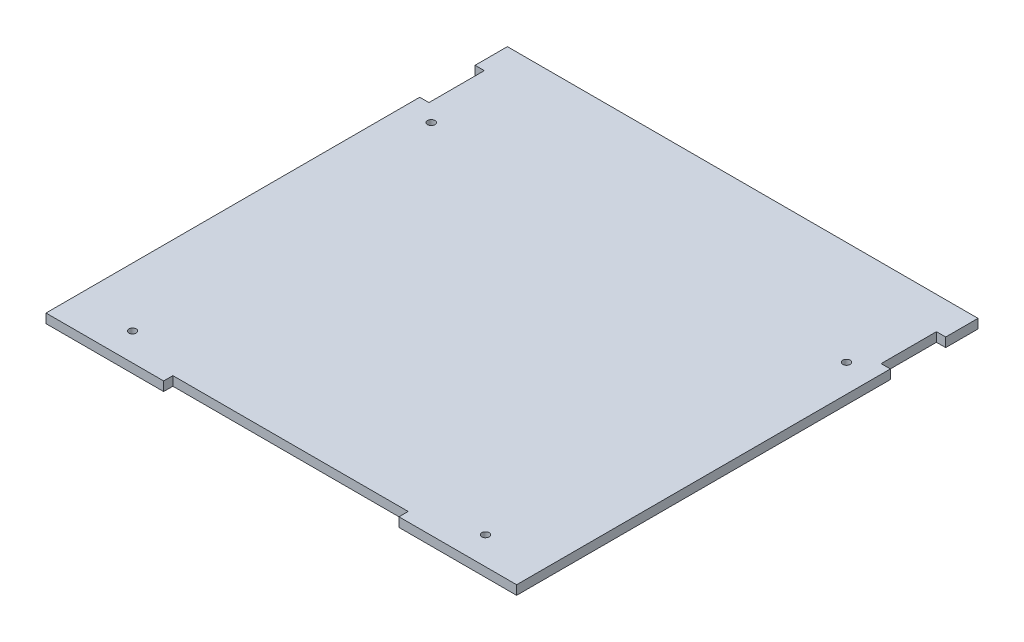
ISO-10303-21;
HEADER;
FILE_DESCRIPTION(('STEP AP214'),'2;1');
FILE_NAME('part.step','',(''),(''),'','','');
FILE_SCHEMA(('AUTOMOTIVE_DESIGN { 1 0 10303 214 1 1 1 1 }'));
ENDSEC;
DATA;
#1=APPLICATION_CONTEXT('core data for automotive mechanical design processes');
#2=APPLICATION_PROTOCOL_DEFINITION('international standard','automotive_design',2000,#1);
#3=PRODUCT_CONTEXT('',#1,'mechanical');
#4=PRODUCT('Part','Part','',(#3));
#5=PRODUCT_RELATED_PRODUCT_CATEGORY('part','',(#4));
#6=PRODUCT_DEFINITION_FORMATION('','',#4);
#7=PRODUCT_DEFINITION_CONTEXT('part definition',#1,'design');
#8=PRODUCT_DEFINITION('design','',#6,#7);
#9=PRODUCT_DEFINITION_SHAPE('','',#8);
#10=(LENGTH_UNIT() NAMED_UNIT(*) SI_UNIT(.MILLI.,.METRE.));
#11=(NAMED_UNIT(*) PLANE_ANGLE_UNIT() SI_UNIT($,.RADIAN.));
#12=(NAMED_UNIT(*) SI_UNIT($,.STERADIAN.) SOLID_ANGLE_UNIT());
#13=UNCERTAINTY_MEASURE_WITH_UNIT(LENGTH_MEASURE(1.E-05),#10,'distance_accuracy_value','');
#14=(GEOMETRIC_REPRESENTATION_CONTEXT(3) GLOBAL_UNCERTAINTY_ASSIGNED_CONTEXT((#13)) GLOBAL_UNIT_ASSIGNED_CONTEXT((#10,
#11,#12)) REPRESENTATION_CONTEXT('',''));
#15=CARTESIAN_POINT('',(0.,0.,0.));
#16=DIRECTION('',(0.,0.,1.));
#17=DIRECTION('',(1.,0.,0.));
#18=AXIS2_PLACEMENT_3D('',#15,#16,#17);
#19=CARTESIAN_POINT('',(0.,5.,0.));
#20=DIRECTION('',(0.,-1.,0.));
#21=DIRECTION('',(0.,0.,-1.));
#22=AXIS2_PLACEMENT_3D('',#19,#20,#21);
#23=PLANE('',#22);
#24=CARTESIAN_POINT('',(240.,5.,-8.75));
#25=DIRECTION('',(0.,1.,0.));
#26=DIRECTION('',(0.,0.,1.));
#27=AXIS2_PLACEMENT_3D('',#24,#25,#26);
#28=CIRCLE('',#27,2.);
#29=CARTESIAN_POINT('',(240.,5.,-6.75));
#30=VERTEX_POINT('',#29);
#31=EDGE_CURVE('E262',#30,#30,#28,.T.);
#32=ORIENTED_EDGE('',*,*,#31,.F.);
#33=EDGE_LOOP('',(#32));
#34=FACE_BOUND('',#33,.T.);
#35=CARTESIAN_POINT('',(15.,5.,-8.75));
#36=DIRECTION('',(0.,1.,0.));
#37=DIRECTION('',(0.,0.,1.));
#38=AXIS2_PLACEMENT_3D('',#35,#36,#37);
#39=CIRCLE('',#38,2.);
#40=CARTESIAN_POINT('',(15.,5.,-6.75));
#41=VERTEX_POINT('',#40);
#42=EDGE_CURVE('E552',#41,#41,#39,.T.);
#43=ORIENTED_EDGE('',*,*,#42,.F.);
#44=EDGE_LOOP('',(#43));
#45=FACE_BOUND('',#44,.T.);
#46=CARTESIAN_POINT('',(31.875,5.,170.));
#47=DIRECTION('',(0.,1.,0.));
#48=DIRECTION('',(0.,0.,1.));
#49=AXIS2_PLACEMENT_3D('',#46,#47,#48);
#50=CIRCLE('',#49,2.);
#51=CARTESIAN_POINT('',(31.875,5.,172.));
#52=VERTEX_POINT('',#51);
#53=EDGE_CURVE('E553',#52,#52,#50,.T.);
#54=ORIENTED_EDGE('',*,*,#53,.F.);
#55=EDGE_LOOP('',(#54));
#56=FACE_BOUND('',#55,.T.);
#57=CARTESIAN_POINT('',(223.125,5.,170.));
#58=DIRECTION('',(0.,1.,0.));
#59=DIRECTION('',(0.,0.,1.));
#60=AXIS2_PLACEMENT_3D('',#57,#58,#59);
#61=CIRCLE('',#60,2.);
#62=CARTESIAN_POINT('',(223.125,5.,172.));
#63=VERTEX_POINT('',#62);
#64=EDGE_CURVE('E558',#63,#63,#61,.T.);
#65=ORIENTED_EDGE('',*,*,#64,.F.);
#66=EDGE_LOOP('',(#65));
#67=FACE_BOUND('',#66,.T.);
#68=DIRECTION('',(-1.,0.,0.));
#69=VECTOR('',#68,1.);
#70=CARTESIAN_POINT('',(255.,5.,185.));
#71=LINE('',#70,#69);
#72=CARTESIAN_POINT('',(63.75,5.,185.));
#73=VERTEX_POINT('',#72);
#74=CARTESIAN_POINT('',(0.,5.,185.));
#75=VERTEX_POINT('',#74);
#76=EDGE_CURVE('E172',#73,#75,#71,.T.);
#77=ORIENTED_EDGE('',*,*,#76,.F.);
#78=DIRECTION('',(0.,0.,1.));
#79=VECTOR('',#78,1.);
#80=CARTESIAN_POINT('',(63.75,5.,180.));
#81=LINE('',#80,#79);
#82=CARTESIAN_POINT('',(63.75,5.,180.));
#83=VERTEX_POINT('',#82);
#84=EDGE_CURVE('E564',#83,#73,#81,.T.);
#85=ORIENTED_EDGE('',*,*,#84,.F.);
#86=DIRECTION('',(-1.,0.,0.));
#87=VECTOR('',#86,1.);
#88=CARTESIAN_POINT('',(127.5,5.,180.));
#89=LINE('',#88,#87);
#90=CARTESIAN_POINT('',(191.25,5.,180.));
#91=VERTEX_POINT('',#90);
#92=EDGE_CURVE('E166',#91,#83,#89,.T.);
#93=ORIENTED_EDGE('',*,*,#92,.F.);
#94=DIRECTION('',(0.,0.,-1.));
#95=VECTOR('',#94,1.);
#96=CARTESIAN_POINT('',(191.25,5.,185.));
#97=LINE('',#96,#95);
#98=CARTESIAN_POINT('',(191.25,5.,185.));
#99=VERTEX_POINT('',#98);
#100=EDGE_CURVE('E151',#99,#91,#97,.T.);
#101=ORIENTED_EDGE('',*,*,#100,.F.);
#102=CARTESIAN_POINT('',(255.,5.,185.));
#103=VERTEX_POINT('',#102);
#104=EDGE_CURVE('E162',#103,#99,#71,.T.);
#105=ORIENTED_EDGE('',*,*,#104,.F.);
#106=DIRECTION('',(0.,0.,-1.));
#107=VECTOR('',#106,1.);
#108=CARTESIAN_POINT('',(255.,5.,0.));
#109=LINE('',#108,#107);
#110=CARTESIAN_POINT('',(255.,5.,-17.5));
#111=VERTEX_POINT('',#110);
#112=EDGE_CURVE('E199',#103,#111,#109,.T.);
#113=ORIENTED_EDGE('',*,*,#112,.T.);
#114=DIRECTION('',(-1.,0.,0.));
#115=VECTOR('',#114,1.);
#116=CARTESIAN_POINT('',(255.,5.,-17.5));
#117=LINE('',#116,#115);
#118=CARTESIAN_POINT('',(250.,5.,-17.5));
#119=VERTEX_POINT('',#118);
#120=EDGE_CURVE('E204',#111,#119,#117,.T.);
#121=ORIENTED_EDGE('',*,*,#120,.T.);
#122=DIRECTION('',(0.,0.,-1.));
#123=VECTOR('',#122,1.);
#124=CARTESIAN_POINT('',(250.,5.,-17.5));
#125=LINE('',#124,#123);
#126=CARTESIAN_POINT('',(250.,5.,-47.5));
#127=VERTEX_POINT('',#126);
#128=EDGE_CURVE('E231',#119,#127,#125,.T.);
#129=ORIENTED_EDGE('',*,*,#128,.T.);
#130=DIRECTION('',(1.,0.,0.));
#131=VECTOR('',#130,1.);
#132=CARTESIAN_POINT('',(250.,5.,-47.5));
#133=LINE('',#132,#131);
#134=CARTESIAN_POINT('',(255.,5.,-47.5));
#135=VERTEX_POINT('',#134);
#136=EDGE_CURVE('E228',#127,#135,#133,.T.);
#137=ORIENTED_EDGE('',*,*,#136,.T.);
#138=CARTESIAN_POINT('',(255.,5.,-65.));
#139=VERTEX_POINT('',#138);
#140=EDGE_CURVE('E196',#135,#139,#109,.T.);
#141=ORIENTED_EDGE('',*,*,#140,.T.);
#142=DIRECTION('',(-1.,0.,0.));
#143=VECTOR('',#142,1.);
#144=CARTESIAN_POINT('',(0.,5.,-65.));
#145=LINE('',#144,#143);
#146=CARTESIAN_POINT('',(0.,5.,-65.));
#147=VERTEX_POINT('',#146);
#148=EDGE_CURVE('E236',#139,#147,#145,.T.);
#149=ORIENTED_EDGE('',*,*,#148,.T.);
#150=DIRECTION('',(0.,0.,1.));
#151=VECTOR('',#150,1.);
#152=CARTESIAN_POINT('',(0.,5.,0.));
#153=LINE('',#152,#151);
#154=CARTESIAN_POINT('',(0.,5.,-47.5));
#155=VERTEX_POINT('',#154);
#156=EDGE_CURVE('E195',#147,#155,#153,.T.);
#157=ORIENTED_EDGE('',*,*,#156,.T.);
#158=DIRECTION('',(-1.,0.,0.));
#159=VECTOR('',#158,1.);
#160=CARTESIAN_POINT('',(5.,5.,-47.5));
#161=LINE('',#160,#159);
#162=CARTESIAN_POINT('',(5.,5.,-47.5));
#163=VERTEX_POINT('',#162);
#164=EDGE_CURVE('E207',#163,#155,#161,.T.);
#165=ORIENTED_EDGE('',*,*,#164,.F.);
#166=DIRECTION('',(0.,0.,-1.));
#167=VECTOR('',#166,1.);
#168=CARTESIAN_POINT('',(5.,5.,-17.5));
#169=LINE('',#168,#167);
#170=CARTESIAN_POINT('',(5.,5.,-17.5));
#171=VERTEX_POINT('',#170);
#172=EDGE_CURVE('E203',#171,#163,#169,.T.);
#173=ORIENTED_EDGE('',*,*,#172,.F.);
#174=DIRECTION('',(1.,0.,0.));
#175=VECTOR('',#174,1.);
#176=CARTESIAN_POINT('',(0.,5.,-17.5));
#177=LINE('',#176,#175);
#178=CARTESIAN_POINT('',(0.,5.,-17.5));
#179=VERTEX_POINT('',#178);
#180=EDGE_CURVE('E200',#179,#171,#177,.T.);
#181=ORIENTED_EDGE('',*,*,#180,.F.);
#182=EDGE_CURVE('E59',#179,#75,#153,.T.);
#183=ORIENTED_EDGE('',*,*,#182,.T.);
#184=EDGE_LOOP('',(#77,#85,#93,#101,#105,#113,#121,#129,#137,#141,#149,#157,#165,#173,#181,#183));
#185=FACE_BOUND('',#184,.T.);
#186=ADVANCED_FACE('F34',(#34,#45,#56,#67,#185),#23,.F.);
#187=CARTESIAN_POINT('',(0.,0.,0.));
#188=DIRECTION('',(0.,-1.,0.));
#189=DIRECTION('',(0.,0.,-1.));
#190=AXIS2_PLACEMENT_3D('',#187,#188,#189);
#191=PLANE('',#190);
#192=CARTESIAN_POINT('',(240.,0.,-8.75));
#193=DIRECTION('',(0.,-1.,0.));
#194=DIRECTION('',(0.,0.,-1.));
#195=AXIS2_PLACEMENT_3D('',#192,#193,#194);
#196=CIRCLE('',#195,2.);
#197=CARTESIAN_POINT('',(240.,0.,-10.75));
#198=VERTEX_POINT('',#197);
#199=EDGE_CURVE('E38',#198,#198,#196,.T.);
#200=ORIENTED_EDGE('',*,*,#199,.F.);
#201=EDGE_LOOP('',(#200));
#202=FACE_BOUND('',#201,.T.);
#203=CARTESIAN_POINT('',(15.,0.,-8.75));
#204=DIRECTION('',(0.,-1.,0.));
#205=DIRECTION('',(0.,0.,-1.));
#206=AXIS2_PLACEMENT_3D('',#203,#204,#205);
#207=CIRCLE('',#206,2.);
#208=CARTESIAN_POINT('',(15.,0.,-10.75));
#209=VERTEX_POINT('',#208);
#210=EDGE_CURVE('E264',#209,#209,#207,.T.);
#211=ORIENTED_EDGE('',*,*,#210,.F.);
#212=EDGE_LOOP('',(#211));
#213=FACE_BOUND('',#212,.T.);
#214=CARTESIAN_POINT('',(31.875,0.,170.));
#215=DIRECTION('',(0.,-1.,0.));
#216=DIRECTION('',(0.,0.,-1.));
#217=AXIS2_PLACEMENT_3D('',#214,#215,#216);
#218=CIRCLE('',#217,2.);
#219=CARTESIAN_POINT('',(31.875,0.,168.));
#220=VERTEX_POINT('',#219);
#221=EDGE_CURVE('E261',#220,#220,#218,.T.);
#222=ORIENTED_EDGE('',*,*,#221,.F.);
#223=EDGE_LOOP('',(#222));
#224=FACE_BOUND('',#223,.T.);
#225=CARTESIAN_POINT('',(223.125,0.,170.));
#226=DIRECTION('',(0.,-1.,0.));
#227=DIRECTION('',(0.,0.,-1.));
#228=AXIS2_PLACEMENT_3D('',#225,#226,#227);
#229=CIRCLE('',#228,2.);
#230=CARTESIAN_POINT('',(223.125,0.,168.));
#231=VERTEX_POINT('',#230);
#232=EDGE_CURVE('E258',#231,#231,#229,.T.);
#233=ORIENTED_EDGE('',*,*,#232,.F.);
#234=EDGE_LOOP('',(#233));
#235=FACE_BOUND('',#234,.T.);
#236=DIRECTION('',(0.,0.,-1.));
#237=VECTOR('',#236,1.);
#238=CARTESIAN_POINT('',(63.75,0.,0.));
#239=LINE('',#238,#237);
#240=CARTESIAN_POINT('',(63.75,0.,185.));
#241=VERTEX_POINT('',#240);
#242=CARTESIAN_POINT('',(63.75,0.,180.));
#243=VERTEX_POINT('',#242);
#244=EDGE_CURVE('E286',#241,#243,#239,.T.);
#245=ORIENTED_EDGE('',*,*,#244,.F.);
#246=DIRECTION('',(1.,0.,0.));
#247=VECTOR('',#246,1.);
#248=CARTESIAN_POINT('',(255.,0.,185.));
#249=LINE('',#248,#247);
#250=CARTESIAN_POINT('',(0.,0.,185.));
#251=VERTEX_POINT('',#250);
#252=EDGE_CURVE('E180',#251,#241,#249,.T.);
#253=ORIENTED_EDGE('',*,*,#252,.F.);
#254=DIRECTION('',(0.,0.,1.));
#255=VECTOR('',#254,1.);
#256=CARTESIAN_POINT('',(0.,0.,-65.));
#257=LINE('',#256,#255);
#258=CARTESIAN_POINT('',(0.,0.,-17.5));
#259=VERTEX_POINT('',#258);
#260=EDGE_CURVE('E183',#259,#251,#257,.T.);
#261=ORIENTED_EDGE('',*,*,#260,.F.);
#262=DIRECTION('',(-1.,0.,0.));
#263=VECTOR('',#262,1.);
#264=CARTESIAN_POINT('',(0.,0.,-17.5));
#265=LINE('',#264,#263);
#266=CARTESIAN_POINT('',(5.,0.,-17.5));
#267=VERTEX_POINT('',#266);
#268=EDGE_CURVE('E250',#267,#259,#265,.T.);
#269=ORIENTED_EDGE('',*,*,#268,.F.);
#270=DIRECTION('',(0.,0.,1.));
#271=VECTOR('',#270,1.);
#272=CARTESIAN_POINT('',(5.,0.,0.));
#273=LINE('',#272,#271);
#274=CARTESIAN_POINT('',(5.,0.,-47.5));
#275=VERTEX_POINT('',#274);
#276=EDGE_CURVE('E253',#275,#267,#273,.T.);
#277=ORIENTED_EDGE('',*,*,#276,.F.);
#278=DIRECTION('',(1.,0.,0.));
#279=VECTOR('',#278,1.);
#280=CARTESIAN_POINT('',(0.,0.,-47.5));
#281=LINE('',#280,#279);
#282=CARTESIAN_POINT('',(0.,0.,-47.5));
#283=VERTEX_POINT('',#282);
#284=EDGE_CURVE('E156',#283,#275,#281,.T.);
#285=ORIENTED_EDGE('',*,*,#284,.F.);
#286=CARTESIAN_POINT('',(0.,0.,-65.));
#287=VERTEX_POINT('',#286);
#288=EDGE_CURVE('E190',#287,#283,#257,.T.);
#289=ORIENTED_EDGE('',*,*,#288,.F.);
#290=DIRECTION('',(-1.,0.,0.));
#291=VECTOR('',#290,1.);
#292=CARTESIAN_POINT('',(0.,0.,-65.));
#293=LINE('',#292,#291);
#294=CARTESIAN_POINT('',(255.,0.,-65.));
#295=VERTEX_POINT('',#294);
#296=EDGE_CURVE('E213',#295,#287,#293,.T.);
#297=ORIENTED_EDGE('',*,*,#296,.F.);
#298=DIRECTION('',(0.,0.,-1.));
#299=VECTOR('',#298,1.);
#300=CARTESIAN_POINT('',(255.,0.,-47.5));
#301=LINE('',#300,#299);
#302=CARTESIAN_POINT('',(255.,0.,-47.5));
#303=VERTEX_POINT('',#302);
#304=EDGE_CURVE('E187',#303,#295,#301,.T.);
#305=ORIENTED_EDGE('',*,*,#304,.F.);
#306=DIRECTION('',(-1.,0.,0.));
#307=VECTOR('',#306,1.);
#308=CARTESIAN_POINT('',(0.,0.,-47.5));
#309=LINE('',#308,#307);
#310=CARTESIAN_POINT('',(250.,0.,-47.5));
#311=VERTEX_POINT('',#310);
#312=EDGE_CURVE('E239',#303,#311,#309,.T.);
#313=ORIENTED_EDGE('',*,*,#312,.T.);
#314=DIRECTION('',(0.,0.,1.));
#315=VECTOR('',#314,1.);
#316=CARTESIAN_POINT('',(250.,0.,0.));
#317=LINE('',#316,#315);
#318=CARTESIAN_POINT('',(250.,0.,-17.5));
#319=VERTEX_POINT('',#318);
#320=EDGE_CURVE('E244',#311,#319,#317,.T.);
#321=ORIENTED_EDGE('',*,*,#320,.T.);
#322=DIRECTION('',(1.,0.,0.));
#323=VECTOR('',#322,1.);
#324=CARTESIAN_POINT('',(0.,0.,-17.5));
#325=LINE('',#324,#323);
#326=CARTESIAN_POINT('',(255.,0.,-17.5));
#327=VERTEX_POINT('',#326);
#328=EDGE_CURVE('E247',#319,#327,#325,.T.);
#329=ORIENTED_EDGE('',*,*,#328,.T.);
#330=CARTESIAN_POINT('',(255.,0.,185.));
#331=VERTEX_POINT('',#330);
#332=EDGE_CURVE('E184',#331,#327,#301,.T.);
#333=ORIENTED_EDGE('',*,*,#332,.F.);
#334=CARTESIAN_POINT('',(191.25,0.,185.));
#335=VERTEX_POINT('',#334);
#336=EDGE_CURVE('E175',#335,#331,#249,.T.);
#337=ORIENTED_EDGE('',*,*,#336,.F.);
#338=DIRECTION('',(0.,0.,1.));
#339=VECTOR('',#338,1.);
#340=CARTESIAN_POINT('',(191.25,0.,0.));
#341=LINE('',#340,#339);
#342=CARTESIAN_POINT('',(191.25,0.,180.));
#343=VERTEX_POINT('',#342);
#344=EDGE_CURVE('E51',#343,#335,#341,.T.);
#345=ORIENTED_EDGE('',*,*,#344,.F.);
#346=DIRECTION('',(1.,0.,0.));
#347=VECTOR('',#346,1.);
#348=CARTESIAN_POINT('',(0.,0.,180.));
#349=LINE('',#348,#347);
#350=EDGE_CURVE('E11',#243,#343,#349,.T.);
#351=ORIENTED_EDGE('',*,*,#350,.F.);
#352=EDGE_LOOP('',(#245,#253,#261,#269,#277,#285,#289,#297,#305,#313,#321,#329,#333,#337,#345,#351));
#353=FACE_BOUND('',#352,.T.);
#354=ADVANCED_FACE('F274',(#202,#213,#224,#235,#353),#191,.T.);
#355=CARTESIAN_POINT('',(0.,0.,185.));
#356=DIRECTION('',(0.,0.,1.));
#357=DIRECTION('',(1.,0.,0.));
#358=AXIS2_PLACEMENT_3D('',#355,#356,#357);
#359=PLANE('',#358);
#360=DIRECTION('',(0.,-1.,0.));
#361=VECTOR('',#360,1.);
#362=CARTESIAN_POINT('',(63.75,0.,185.));
#363=LINE('',#362,#361);
#364=EDGE_CURVE('E43',#73,#241,#363,.T.);
#365=ORIENTED_EDGE('',*,*,#364,.F.);
#366=ORIENTED_EDGE('',*,*,#76,.T.);
#367=DIRECTION('',(0.,-1.,0.));
#368=VECTOR('',#367,1.);
#369=CARTESIAN_POINT('',(0.,0.,185.));
#370=LINE('',#369,#368);
#371=EDGE_CURVE('E171',#75,#251,#370,.T.);
#372=ORIENTED_EDGE('',*,*,#371,.T.);
#373=ORIENTED_EDGE('',*,*,#252,.T.);
#374=EDGE_LOOP('',(#365,#366,#372,#373));
#375=FACE_BOUND('',#374,.T.);
#376=ADVANCED_FACE('F277',(#375),#359,.T.);
#377=CARTESIAN_POINT('',(0.,5.,-65.));
#378=DIRECTION('',(0.,0.,1.));
#379=DIRECTION('',(1.,0.,0.));
#380=AXIS2_PLACEMENT_3D('',#377,#378,#379);
#381=PLANE('',#380);
#382=ORIENTED_EDGE('',*,*,#148,.F.);
#383=DIRECTION('',(0.,-1.,0.));
#384=VECTOR('',#383,1.);
#385=CARTESIAN_POINT('',(255.,10.,-65.));
#386=LINE('',#385,#384);
#387=EDGE_CURVE('E186',#139,#295,#386,.T.);
#388=ORIENTED_EDGE('',*,*,#387,.T.);
#389=ORIENTED_EDGE('',*,*,#296,.T.);
#390=DIRECTION('',(0.,-1.,0.));
#391=VECTOR('',#390,1.);
#392=CARTESIAN_POINT('',(0.,10.,-65.));
#393=LINE('',#392,#391);
#394=EDGE_CURVE('E192',#147,#287,#393,.T.);
#395=ORIENTED_EDGE('',*,*,#394,.F.);
#396=EDGE_LOOP('',(#382,#388,#389,#395));
#397=FACE_BOUND('',#396,.T.);
#398=ADVANCED_FACE('F36',(#397),#381,.F.);
#399=CARTESIAN_POINT('',(255.,-5.,-17.5));
#400=DIRECTION('',(0.,0.,-1.));
#401=DIRECTION('',(-1.,0.,0.));
#402=AXIS2_PLACEMENT_3D('',#399,#400,#401);
#403=PLANE('',#402);
#404=DIRECTION('',(0.,1.,0.));
#405=VECTOR('',#404,1.);
#406=CARTESIAN_POINT('',(250.,-5.,-17.5));
#407=LINE('',#406,#405);
#408=EDGE_CURVE('E221',#319,#119,#407,.T.);
#409=ORIENTED_EDGE('',*,*,#408,.T.);
#410=ORIENTED_EDGE('',*,*,#120,.F.);
#411=DIRECTION('',(0.,1.,0.));
#412=VECTOR('',#411,1.);
#413=CARTESIAN_POINT('',(255.,-5.,-17.5));
#414=LINE('',#413,#412);
#415=EDGE_CURVE('E219',#327,#111,#414,.T.);
#416=ORIENTED_EDGE('',*,*,#415,.F.);
#417=ORIENTED_EDGE('',*,*,#328,.F.);
#418=EDGE_LOOP('',(#409,#410,#416,#417));
#419=FACE_BOUND('',#418,.T.);
#420=ADVANCED_FACE('F329',(#419),#403,.T.);
#421=CARTESIAN_POINT('',(250.,-5.,-17.5));
#422=DIRECTION('',(1.,0.,0.));
#423=DIRECTION('',(0.,0.,-1.));
#424=AXIS2_PLACEMENT_3D('',#421,#422,#423);
#425=PLANE('',#424);
#426=DIRECTION('',(0.,1.,0.));
#427=VECTOR('',#426,1.);
#428=CARTESIAN_POINT('',(250.,-5.,-47.5));
#429=LINE('',#428,#427);
#430=EDGE_CURVE('E223',#311,#127,#429,.T.);
#431=ORIENTED_EDGE('',*,*,#430,.T.);
#432=ORIENTED_EDGE('',*,*,#128,.F.);
#433=ORIENTED_EDGE('',*,*,#408,.F.);
#434=ORIENTED_EDGE('',*,*,#320,.F.);
#435=EDGE_LOOP('',(#431,#432,#433,#434));
#436=FACE_BOUND('',#435,.T.);
#437=ADVANCED_FACE('F325',(#436),#425,.T.);
#438=CARTESIAN_POINT('',(250.,-5.,-47.5));
#439=DIRECTION('',(0.,0.,1.));
#440=DIRECTION('',(1.,0.,0.));
#441=AXIS2_PLACEMENT_3D('',#438,#439,#440);
#442=PLANE('',#441);
#443=DIRECTION('',(0.,1.,0.));
#444=VECTOR('',#443,1.);
#445=CARTESIAN_POINT('',(255.,-5.,-47.5));
#446=LINE('',#445,#444);
#447=EDGE_CURVE('E225',#303,#135,#446,.T.);
#448=ORIENTED_EDGE('',*,*,#447,.T.);
#449=ORIENTED_EDGE('',*,*,#136,.F.);
#450=ORIENTED_EDGE('',*,*,#430,.F.);
#451=ORIENTED_EDGE('',*,*,#312,.F.);
#452=EDGE_LOOP('',(#448,#449,#450,#451));
#453=FACE_BOUND('',#452,.T.);
#454=ADVANCED_FACE('F319',(#453),#442,.T.);
#455=CARTESIAN_POINT('',(5.,-5.,-47.5));
#456=DIRECTION('',(0.,0.,-1.));
#457=DIRECTION('',(-1.,0.,0.));
#458=AXIS2_PLACEMENT_3D('',#455,#456,#457);
#459=PLANE('',#458);
#460=ORIENTED_EDGE('',*,*,#284,.T.);
#461=DIRECTION('',(0.,1.,0.));
#462=VECTOR('',#461,1.);
#463=CARTESIAN_POINT('',(5.,-5.,-47.5));
#464=LINE('',#463,#462);
#465=EDGE_CURVE('E214',#275,#163,#464,.T.);
#466=ORIENTED_EDGE('',*,*,#465,.T.);
#467=ORIENTED_EDGE('',*,*,#164,.T.);
#468=DIRECTION('',(0.,1.,0.));
#469=VECTOR('',#468,1.);
#470=CARTESIAN_POINT('',(0.,-5.,-47.5));
#471=LINE('',#470,#469);
#472=EDGE_CURVE('E211',#283,#155,#471,.T.);
#473=ORIENTED_EDGE('',*,*,#472,.F.);
#474=EDGE_LOOP('',(#460,#466,#467,#473));
#475=FACE_BOUND('',#474,.T.);
#476=ADVANCED_FACE('F307',(#475),#459,.F.);
#477=CARTESIAN_POINT('',(5.,-5.,-17.5));
#478=DIRECTION('',(1.,0.,0.));
#479=DIRECTION('',(0.,0.,-1.));
#480=AXIS2_PLACEMENT_3D('',#477,#478,#479);
#481=PLANE('',#480);
#482=ORIENTED_EDGE('',*,*,#276,.T.);
#483=DIRECTION('',(0.,1.,0.));
#484=VECTOR('',#483,1.);
#485=CARTESIAN_POINT('',(5.,-5.,-17.5));
#486=LINE('',#485,#484);
#487=EDGE_CURVE('E216',#267,#171,#486,.T.);
#488=ORIENTED_EDGE('',*,*,#487,.T.);
#489=ORIENTED_EDGE('',*,*,#172,.T.);
#490=ORIENTED_EDGE('',*,*,#465,.F.);
#491=EDGE_LOOP('',(#482,#488,#489,#490));
#492=FACE_BOUND('',#491,.T.);
#493=ADVANCED_FACE('F301',(#492),#481,.F.);
#494=CARTESIAN_POINT('',(0.,-5.,-17.5));
#495=DIRECTION('',(0.,0.,1.));
#496=DIRECTION('',(1.,0.,0.));
#497=AXIS2_PLACEMENT_3D('',#494,#495,#496);
#498=PLANE('',#497);
#499=ORIENTED_EDGE('',*,*,#268,.T.);
#500=DIRECTION('',(0.,1.,0.));
#501=VECTOR('',#500,1.);
#502=CARTESIAN_POINT('',(0.,-5.,-17.5));
#503=LINE('',#502,#501);
#504=EDGE_CURVE('E210',#259,#179,#503,.T.);
#505=ORIENTED_EDGE('',*,*,#504,.T.);
#506=ORIENTED_EDGE('',*,*,#180,.T.);
#507=ORIENTED_EDGE('',*,*,#487,.F.);
#508=EDGE_LOOP('',(#499,#505,#506,#507));
#509=FACE_BOUND('',#508,.T.);
#510=ADVANCED_FACE('F296',(#509),#498,.F.);
#511=CARTESIAN_POINT('',(0.,10.,-65.));
#512=DIRECTION('',(1.,0.,0.));
#513=DIRECTION('',(0.,0.,-1.));
#514=AXIS2_PLACEMENT_3D('',#511,#512,#513);
#515=PLANE('',#514);
#516=ORIENTED_EDGE('',*,*,#504,.F.);
#517=ORIENTED_EDGE('',*,*,#260,.T.);
#518=ORIENTED_EDGE('',*,*,#371,.F.);
#519=ORIENTED_EDGE('',*,*,#182,.F.);
#520=EDGE_LOOP('',(#516,#517,#518,#519));
#521=FACE_BOUND('',#520,.T.);
#522=ADVANCED_FACE('F292',(#521),#515,.F.);
#523=ORIENTED_EDGE('',*,*,#394,.T.);
#524=ORIENTED_EDGE('',*,*,#288,.T.);
#525=ORIENTED_EDGE('',*,*,#472,.T.);
#526=ORIENTED_EDGE('',*,*,#156,.F.);
#527=EDGE_LOOP('',(#523,#524,#525,#526));
#528=FACE_BOUND('',#527,.T.);
#529=ADVANCED_FACE('F311',(#528),#515,.F.);
#530=CARTESIAN_POINT('',(255.,10.,-47.5));
#531=DIRECTION('',(-1.,0.,0.));
#532=DIRECTION('',(0.,0.,1.));
#533=AXIS2_PLACEMENT_3D('',#530,#531,#532);
#534=PLANE('',#533);
#535=ORIENTED_EDGE('',*,*,#447,.F.);
#536=ORIENTED_EDGE('',*,*,#304,.T.);
#537=ORIENTED_EDGE('',*,*,#387,.F.);
#538=ORIENTED_EDGE('',*,*,#140,.F.);
#539=EDGE_LOOP('',(#535,#536,#537,#538));
#540=FACE_BOUND('',#539,.T.);
#541=ADVANCED_FACE('F334',(#540),#534,.F.);
#542=ORIENTED_EDGE('',*,*,#112,.F.);
#543=DIRECTION('',(0.,1.,0.));
#544=VECTOR('',#543,1.);
#545=CARTESIAN_POINT('',(255.,0.,185.));
#546=LINE('',#545,#544);
#547=EDGE_CURVE('E170',#331,#103,#546,.T.);
#548=ORIENTED_EDGE('',*,*,#547,.F.);
#549=ORIENTED_EDGE('',*,*,#332,.T.);
#550=ORIENTED_EDGE('',*,*,#415,.T.);
#551=EDGE_LOOP('',(#542,#548,#549,#550));
#552=FACE_BOUND('',#551,.T.);
#553=ADVANCED_FACE('F332',(#552),#534,.F.);
#554=DIRECTION('',(0.,1.,0.));
#555=VECTOR('',#554,1.);
#556=CARTESIAN_POINT('',(191.25,0.,185.));
#557=LINE('',#556,#555);
#558=EDGE_CURVE('E148',#335,#99,#557,.T.);
#559=ORIENTED_EDGE('',*,*,#558,.F.);
#560=ORIENTED_EDGE('',*,*,#336,.T.);
#561=ORIENTED_EDGE('',*,*,#547,.T.);
#562=ORIENTED_EDGE('',*,*,#104,.T.);
#563=EDGE_LOOP('',(#559,#560,#561,#562));
#564=FACE_BOUND('',#563,.T.);
#565=ADVANCED_FACE('F168',(#564),#359,.T.);
#566=CARTESIAN_POINT('',(63.75,-180.,180.));
#567=DIRECTION('',(-1.,0.,0.));
#568=DIRECTION('',(0.,0.,1.));
#569=AXIS2_PLACEMENT_3D('',#566,#567,#568);
#570=PLANE('',#569);
#571=ORIENTED_EDGE('',*,*,#244,.T.);
#572=DIRECTION('',(0.,1.,0.));
#573=VECTOR('',#572,1.);
#574=CARTESIAN_POINT('',(63.75,-180.,180.));
#575=LINE('',#574,#573);
#576=EDGE_CURVE('E567',#243,#83,#575,.T.);
#577=ORIENTED_EDGE('',*,*,#576,.T.);
#578=ORIENTED_EDGE('',*,*,#84,.T.);
#579=ORIENTED_EDGE('',*,*,#364,.T.);
#580=EDGE_LOOP('',(#571,#577,#578,#579));
#581=FACE_BOUND('',#580,.T.);
#582=ADVANCED_FACE('F341',(#581),#570,.F.);
#583=CARTESIAN_POINT('',(127.5,-180.,180.));
#584=DIRECTION('',(0.,0.,-1.));
#585=DIRECTION('',(-1.,0.,0.));
#586=AXIS2_PLACEMENT_3D('',#583,#584,#585);
#587=PLANE('',#586);
#588=ORIENTED_EDGE('',*,*,#350,.T.);
#589=DIRECTION('',(0.,1.,0.));
#590=VECTOR('',#589,1.);
#591=CARTESIAN_POINT('',(191.25,-180.,180.));
#592=LINE('',#591,#590);
#593=EDGE_CURVE('E566',#343,#91,#592,.T.);
#594=ORIENTED_EDGE('',*,*,#593,.T.);
#595=ORIENTED_EDGE('',*,*,#92,.T.);
#596=ORIENTED_EDGE('',*,*,#576,.F.);
#597=EDGE_LOOP('',(#588,#594,#595,#596));
#598=FACE_BOUND('',#597,.T.);
#599=ADVANCED_FACE('F464',(#598),#587,.F.);
#600=CARTESIAN_POINT('',(191.25,-180.,185.));
#601=DIRECTION('',(1.,0.,0.));
#602=DIRECTION('',(0.,0.,-1.));
#603=AXIS2_PLACEMENT_3D('',#600,#601,#602);
#604=PLANE('',#603);
#605=ORIENTED_EDGE('',*,*,#344,.T.);
#606=ORIENTED_EDGE('',*,*,#558,.T.);
#607=ORIENTED_EDGE('',*,*,#100,.T.);
#608=ORIENTED_EDGE('',*,*,#593,.F.);
#609=EDGE_LOOP('',(#605,#606,#607,#608));
#610=FACE_BOUND('',#609,.T.);
#611=ADVANCED_FACE('F150',(#610),#604,.F.);
#612=CARTESIAN_POINT('',(223.125,-5.,170.));
#613=DIRECTION('',(0.,1.,0.));
#614=DIRECTION('',(0.,0.,1.));
#615=AXIS2_PLACEMENT_3D('',#612,#613,#614);
#616=CYLINDRICAL_SURFACE('',#615,2.);
#617=ORIENTED_EDGE('',*,*,#232,.T.);
#618=EDGE_LOOP('',(#617));
#619=FACE_BOUND('',#618,.T.);
#620=ORIENTED_EDGE('',*,*,#64,.T.);
#621=EDGE_LOOP('',(#620));
#622=FACE_BOUND('',#621,.T.);
#623=ADVANCED_FACE('F482',(#619,#622),#616,.F.);
#624=CARTESIAN_POINT('',(31.875,-5.,170.));
#625=DIRECTION('',(0.,1.,0.));
#626=DIRECTION('',(0.,0.,1.));
#627=AXIS2_PLACEMENT_3D('',#624,#625,#626);
#628=CYLINDRICAL_SURFACE('',#627,2.);
#629=ORIENTED_EDGE('',*,*,#221,.T.);
#630=EDGE_LOOP('',(#629));
#631=FACE_BOUND('',#630,.T.);
#632=ORIENTED_EDGE('',*,*,#53,.T.);
#633=EDGE_LOOP('',(#632));
#634=FACE_BOUND('',#633,.T.);
#635=ADVANCED_FACE('F516',(#631,#634),#628,.F.);
#636=CARTESIAN_POINT('',(15.,-5.,-8.75));
#637=DIRECTION('',(0.,1.,0.));
#638=DIRECTION('',(0.,0.,1.));
#639=AXIS2_PLACEMENT_3D('',#636,#637,#638);
#640=CYLINDRICAL_SURFACE('',#639,2.);
#641=ORIENTED_EDGE('',*,*,#210,.T.);
#642=EDGE_LOOP('',(#641));
#643=FACE_BOUND('',#642,.T.);
#644=ORIENTED_EDGE('',*,*,#42,.T.);
#645=EDGE_LOOP('',(#644));
#646=FACE_BOUND('',#645,.T.);
#647=ADVANCED_FACE('F525',(#643,#646),#640,.F.);
#648=CARTESIAN_POINT('',(240.,-5.,-8.75));
#649=DIRECTION('',(0.,1.,0.));
#650=DIRECTION('',(0.,0.,1.));
#651=AXIS2_PLACEMENT_3D('',#648,#649,#650);
#652=CYLINDRICAL_SURFACE('',#651,2.);
#653=ORIENTED_EDGE('',*,*,#199,.T.);
#654=EDGE_LOOP('',(#653));
#655=FACE_BOUND('',#654,.T.);
#656=ORIENTED_EDGE('',*,*,#31,.T.);
#657=EDGE_LOOP('',(#656));
#658=FACE_BOUND('',#657,.T.);
#659=ADVANCED_FACE('F271',(#655,#658),#652,.F.);
#660=CLOSED_SHELL('',(#186,#354,#376,#398,#420,#437,#454,#476,#493,#510,#522,#529,#541,#553,
#565,#582,#599,#611,#623,#635,#647,#659));
#661=MANIFOLD_SOLID_BREP('B2',#660);
#662=ADVANCED_BREP_SHAPE_REPRESENTATION('',(#18,#661),#14);
#663=SHAPE_DEFINITION_REPRESENTATION(#9,#662);
ENDSEC;
END-ISO-10303-21;
